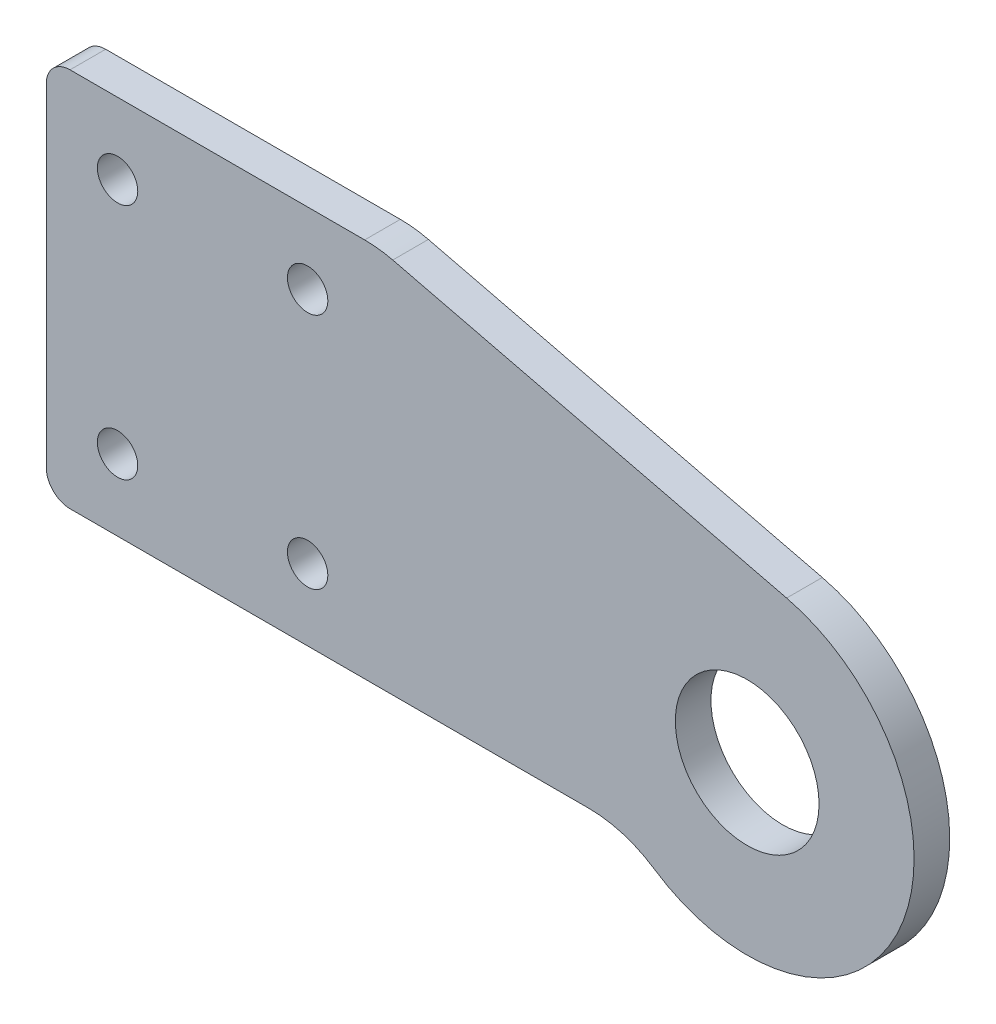
ISO-10303-21;
HEADER;
FILE_DESCRIPTION(('STEP AP214'),'2;1');
FILE_NAME('part.step','',(''),(''),'','','');
FILE_SCHEMA(('AUTOMOTIVE_DESIGN { 1 0 10303 214 1 1 1 1 }'));
ENDSEC;
DATA;
#1=APPLICATION_CONTEXT('core data for automotive mechanical design processes');
#2=APPLICATION_PROTOCOL_DEFINITION('international standard','automotive_design',2000,#1);
#3=PRODUCT_CONTEXT('',#1,'mechanical');
#4=PRODUCT('Part','Part','',(#3));
#5=PRODUCT_RELATED_PRODUCT_CATEGORY('part','',(#4));
#6=PRODUCT_DEFINITION_FORMATION('','',#4);
#7=PRODUCT_DEFINITION_CONTEXT('part definition',#1,'design');
#8=PRODUCT_DEFINITION('design','',#6,#7);
#9=PRODUCT_DEFINITION_SHAPE('','',#8);
#10=(LENGTH_UNIT() NAMED_UNIT(*) SI_UNIT(.MILLI.,.METRE.));
#11=(NAMED_UNIT(*) PLANE_ANGLE_UNIT() SI_UNIT($,.RADIAN.));
#12=(NAMED_UNIT(*) SI_UNIT($,.STERADIAN.) SOLID_ANGLE_UNIT());
#13=UNCERTAINTY_MEASURE_WITH_UNIT(LENGTH_MEASURE(1.E-05),#10,'distance_accuracy_value','');
#14=(GEOMETRIC_REPRESENTATION_CONTEXT(3) GLOBAL_UNCERTAINTY_ASSIGNED_CONTEXT((#13)) GLOBAL_UNIT_ASSIGNED_CONTEXT((#10,
#11,#12)) REPRESENTATION_CONTEXT('',''));
#15=CARTESIAN_POINT('',(0.,0.,0.));
#16=DIRECTION('',(0.,0.,1.));
#17=DIRECTION('',(1.,0.,0.));
#18=AXIS2_PLACEMENT_3D('',#15,#16,#17);
#19=CARTESIAN_POINT('',(0.,0.,0.75));
#20=DIRECTION('',(0.,0.,1.));
#21=DIRECTION('',(1.,0.,0.));
#22=AXIS2_PLACEMENT_3D('',#19,#20,#21);
#23=PLANE('',#22);
#24=CARTESIAN_POINT('',(-18.5,-2.,0.75));
#25=DIRECTION('',(0.,0.,1.));
#26=DIRECTION('',(1.,0.,0.));
#27=AXIS2_PLACEMENT_3D('',#24,#25,#26);
#28=CIRCLE('',#27,0.85);
#29=CARTESIAN_POINT('',(-17.65,-2.,0.75));
#30=VERTEX_POINT('',#29);
#31=EDGE_CURVE('E344',#30,#30,#28,.T.);
#32=ORIENTED_EDGE('',*,*,#31,.F.);
#33=EDGE_LOOP('',(#32));
#34=FACE_BOUND('',#33,.T.);
#35=CARTESIAN_POINT('',(-26.5,8.,0.75));
#36=DIRECTION('',(0.,0.,1.));
#37=DIRECTION('',(1.,0.,0.));
#38=AXIS2_PLACEMENT_3D('',#35,#36,#37);
#39=CIRCLE('',#38,0.85);
#40=CARTESIAN_POINT('',(-25.65,8.,0.75));
#41=VERTEX_POINT('',#40);
#42=EDGE_CURVE('E363',#41,#41,#39,.T.);
#43=ORIENTED_EDGE('',*,*,#42,.F.);
#44=EDGE_LOOP('',(#43));
#45=FACE_BOUND('',#44,.T.);
#46=DIRECTION('',(0.,-1.,0.));
#47=VECTOR('',#46,1.);
#48=CARTESIAN_POINT('',(-29.5,11.,0.75));
#49=LINE('',#48,#47);
#50=CARTESIAN_POINT('',(-29.5,10.,0.75));
#51=VERTEX_POINT('',#50);
#52=CARTESIAN_POINT('',(-29.5,-4.,0.75));
#53=VERTEX_POINT('',#52);
#54=EDGE_CURVE('E145',#51,#53,#49,.T.);
#55=ORIENTED_EDGE('',*,*,#54,.T.);
#56=CARTESIAN_POINT('',(-28.5,-4.,0.75));
#57=DIRECTION('',(0.,0.,1.));
#58=DIRECTION('',(1.,0.,0.));
#59=AXIS2_PLACEMENT_3D('',#56,#57,#58);
#60=CIRCLE('',#59,1.);
#61=CARTESIAN_POINT('',(-28.5,-5.,0.75));
#62=VERTEX_POINT('',#61);
#63=EDGE_CURVE('E40',#53,#62,#60,.T.);
#64=ORIENTED_EDGE('',*,*,#63,.T.);
#65=DIRECTION('',(1.,0.,0.));
#66=VECTOR('',#65,1.);
#67=CARTESIAN_POINT('',(-29.5,-5.,0.75));
#68=LINE('',#67,#66);
#69=CARTESIAN_POINT('',(-6.67836993584512,-5.,0.75));
#70=VERTEX_POINT('',#69);
#71=EDGE_CURVE('E116',#62,#70,#68,.T.);
#72=ORIENTED_EDGE('',*,*,#71,.T.);
#73=CARTESIAN_POINT('',(-6.67836993584512,-10.,0.75));
#74=DIRECTION('',(0.,0.,1.));
#75=DIRECTION('',(1.,0.,0.));
#76=AXIS2_PLACEMENT_3D('',#73,#74,#75);
#77=CIRCLE('',#76,5.);
#78=CARTESIAN_POINT('',(-3.90150093965173,-5.84199584199584,0.75));
#79=VERTEX_POINT('',#78);
#80=EDGE_CURVE('E112',#70,#79,#77,.F.);
#81=ORIENTED_EDGE('',*,*,#80,.T.);
#82=CARTESIAN_POINT('',(0.,0.,0.75));
#83=DIRECTION('',(0.,0.,1.));
#84=DIRECTION('',(1.,0.,0.));
#85=AXIS2_PLACEMENT_3D('',#82,#83,#84);
#86=CIRCLE('',#85,7.025);
#87=CARTESIAN_POINT('',(1.66032893490754,6.82597486282427,0.75));
#88=VERTEX_POINT('',#87);
#89=EDGE_CURVE('E105',#79,#88,#86,.T.);
#90=ORIENTED_EDGE('',*,*,#89,.T.);
#91=DIRECTION('',(-0.971669019619113,0.236345755858725,0.));
#92=VECTOR('',#91,1.);
#93=CARTESIAN_POINT('',(-15.5,11.,0.75));
#94=LINE('',#93,#92);
#95=CARTESIAN_POINT('',(-14.9176257612174,10.8583450980956,0.75));
#96=VERTEX_POINT('',#95);
#97=EDGE_CURVE('E109',#88,#96,#94,.T.);
#98=ORIENTED_EDGE('',*,*,#97,.T.);
#99=CARTESIAN_POINT('',(-16.099354540511,6.,0.75));
#100=DIRECTION('',(0.,0.,1.));
#101=DIRECTION('',(1.,0.,0.));
#102=AXIS2_PLACEMENT_3D('',#99,#100,#101);
#103=CIRCLE('',#102,5.);
#104=CARTESIAN_POINT('',(-16.099354540511,11.,0.75));
#105=VERTEX_POINT('',#104);
#106=EDGE_CURVE('E157',#96,#105,#103,.T.);
#107=ORIENTED_EDGE('',*,*,#106,.T.);
#108=DIRECTION('',(-1.,0.,0.));
#109=VECTOR('',#108,1.);
#110=CARTESIAN_POINT('',(-29.5,11.,0.75));
#111=LINE('',#110,#109);
#112=CARTESIAN_POINT('',(-28.5,11.,0.75));
#113=VERTEX_POINT('',#112);
#114=EDGE_CURVE('E127',#105,#113,#111,.T.);
#115=ORIENTED_EDGE('',*,*,#114,.T.);
#116=CARTESIAN_POINT('',(-28.5,10.,0.75));
#117=DIRECTION('',(0.,0.,1.));
#118=DIRECTION('',(1.,0.,0.));
#119=AXIS2_PLACEMENT_3D('',#116,#117,#118);
#120=CIRCLE('',#119,1.);
#121=EDGE_CURVE('E174',#113,#51,#120,.T.);
#122=ORIENTED_EDGE('',*,*,#121,.T.);
#123=EDGE_LOOP('',(#55,#64,#72,#81,#90,#98,#107,#115,#122));
#124=FACE_BOUND('',#123,.T.);
#125=CARTESIAN_POINT('',(0.,0.,0.75));
#126=DIRECTION('',(0.,0.,1.));
#127=DIRECTION('',(1.,0.,0.));
#128=AXIS2_PLACEMENT_3D('',#125,#126,#127);
#129=CIRCLE('',#128,3.025);
#130=CARTESIAN_POINT('',(3.025,0.,0.75));
#131=VERTEX_POINT('',#130);
#132=EDGE_CURVE('E139',#131,#131,#129,.T.);
#133=ORIENTED_EDGE('',*,*,#132,.F.);
#134=EDGE_LOOP('',(#133));
#135=FACE_BOUND('',#134,.T.);
#136=CARTESIAN_POINT('',(-18.5,8.,0.75));
#137=DIRECTION('',(0.,0.,1.));
#138=DIRECTION('',(1.,0.,0.));
#139=AXIS2_PLACEMENT_3D('',#136,#137,#138);
#140=CIRCLE('',#139,0.85);
#141=CARTESIAN_POINT('',(-17.65,8.,0.75));
#142=VERTEX_POINT('',#141);
#143=EDGE_CURVE('E357',#142,#142,#140,.T.);
#144=ORIENTED_EDGE('',*,*,#143,.F.);
#145=EDGE_LOOP('',(#144));
#146=FACE_BOUND('',#145,.T.);
#147=CARTESIAN_POINT('',(-26.5,-2.,0.75));
#148=DIRECTION('',(0.,0.,1.));
#149=DIRECTION('',(1.,0.,0.));
#150=AXIS2_PLACEMENT_3D('',#147,#148,#149);
#151=CIRCLE('',#150,0.85);
#152=CARTESIAN_POINT('',(-25.65,-2.,0.75));
#153=VERTEX_POINT('',#152);
#154=EDGE_CURVE('E348',#153,#153,#151,.T.);
#155=ORIENTED_EDGE('',*,*,#154,.F.);
#156=EDGE_LOOP('',(#155));
#157=FACE_BOUND('',#156,.T.);
#158=ADVANCED_FACE('F32',(#34,#45,#124,#135,#146,#157),#23,.T.);
#159=CARTESIAN_POINT('',(0.,0.,-0.75));
#160=DIRECTION('',(0.,0.,1.));
#161=DIRECTION('',(1.,0.,0.));
#162=AXIS2_PLACEMENT_3D('',#159,#160,#161);
#163=PLANE('',#162);
#164=CARTESIAN_POINT('',(-18.5,-2.,-0.75));
#165=DIRECTION('',(0.,0.,1.));
#166=DIRECTION('',(1.,0.,0.));
#167=AXIS2_PLACEMENT_3D('',#164,#165,#166);
#168=CIRCLE('',#167,0.85);
#169=CARTESIAN_POINT('',(-17.65,-2.,-0.75));
#170=VERTEX_POINT('',#169);
#171=EDGE_CURVE('E347',#170,#170,#168,.T.);
#172=ORIENTED_EDGE('',*,*,#171,.T.);
#173=EDGE_LOOP('',(#172));
#174=FACE_BOUND('',#173,.T.);
#175=CARTESIAN_POINT('',(-26.5,8.,-0.75));
#176=DIRECTION('',(0.,0.,1.));
#177=DIRECTION('',(1.,0.,0.));
#178=AXIS2_PLACEMENT_3D('',#175,#176,#177);
#179=CIRCLE('',#178,0.85);
#180=CARTESIAN_POINT('',(-25.65,8.,-0.75));
#181=VERTEX_POINT('',#180);
#182=EDGE_CURVE('E360',#181,#181,#179,.T.);
#183=ORIENTED_EDGE('',*,*,#182,.T.);
#184=EDGE_LOOP('',(#183));
#185=FACE_BOUND('',#184,.T.);
#186=DIRECTION('',(1.,0.,0.));
#187=VECTOR('',#186,1.);
#188=CARTESIAN_POINT('',(-15.5,-5.,-0.75));
#189=LINE('',#188,#187);
#190=CARTESIAN_POINT('',(-28.5,-5.,-0.75));
#191=VERTEX_POINT('',#190);
#192=CARTESIAN_POINT('',(-6.67836993584512,-5.,-0.75));
#193=VERTEX_POINT('',#192);
#194=EDGE_CURVE('E138',#191,#193,#189,.T.);
#195=ORIENTED_EDGE('',*,*,#194,.F.);
#196=CARTESIAN_POINT('',(-28.5,-4.,-0.75));
#197=DIRECTION('',(0.,0.,1.));
#198=DIRECTION('',(1.,0.,0.));
#199=AXIS2_PLACEMENT_3D('',#196,#197,#198);
#200=CIRCLE('',#199,1.);
#201=CARTESIAN_POINT('',(-29.5,-4.,-0.75));
#202=VERTEX_POINT('',#201);
#203=EDGE_CURVE('E168',#191,#202,#200,.F.);
#204=ORIENTED_EDGE('',*,*,#203,.T.);
#205=DIRECTION('',(0.,-1.,0.));
#206=VECTOR('',#205,1.);
#207=CARTESIAN_POINT('',(-29.5,11.,-0.75));
#208=LINE('',#207,#206);
#209=CARTESIAN_POINT('',(-29.5,10.,-0.75));
#210=VERTEX_POINT('',#209);
#211=EDGE_CURVE('E136',#210,#202,#208,.T.);
#212=ORIENTED_EDGE('',*,*,#211,.F.);
#213=CARTESIAN_POINT('',(-28.5,10.,-0.75));
#214=DIRECTION('',(0.,0.,1.));
#215=DIRECTION('',(1.,0.,0.));
#216=AXIS2_PLACEMENT_3D('',#213,#214,#215);
#217=CIRCLE('',#216,1.);
#218=CARTESIAN_POINT('',(-28.5,11.,-0.75));
#219=VERTEX_POINT('',#218);
#220=EDGE_CURVE('E166',#210,#219,#217,.F.);
#221=ORIENTED_EDGE('',*,*,#220,.T.);
#222=DIRECTION('',(-1.,0.,0.));
#223=VECTOR('',#222,1.);
#224=CARTESIAN_POINT('',(-29.5,11.,-0.75));
#225=LINE('',#224,#223);
#226=CARTESIAN_POINT('',(-16.099354540511,11.,-0.75));
#227=VERTEX_POINT('',#226);
#228=EDGE_CURVE('E144',#227,#219,#225,.T.);
#229=ORIENTED_EDGE('',*,*,#228,.F.);
#230=CARTESIAN_POINT('',(-16.099354540511,6.,-0.75));
#231=DIRECTION('',(0.,0.,1.));
#232=DIRECTION('',(1.,0.,0.));
#233=AXIS2_PLACEMENT_3D('',#230,#231,#232);
#234=CIRCLE('',#233,5.);
#235=CARTESIAN_POINT('',(-14.9176257612174,10.8583450980956,-0.75));
#236=VERTEX_POINT('',#235);
#237=EDGE_CURVE('E154',#227,#236,#234,.F.);
#238=ORIENTED_EDGE('',*,*,#237,.T.);
#239=DIRECTION('',(-0.971669019619113,0.236345755858725,0.));
#240=VECTOR('',#239,1.);
#241=CARTESIAN_POINT('',(-15.5,11.,-0.75));
#242=LINE('',#241,#240);
#243=CARTESIAN_POINT('',(1.66032893490754,6.82597486282427,-0.75));
#244=VERTEX_POINT('',#243);
#245=EDGE_CURVE('E142',#244,#236,#242,.T.);
#246=ORIENTED_EDGE('',*,*,#245,.F.);
#247=CARTESIAN_POINT('',(0.,0.,-0.75));
#248=DIRECTION('',(0.,0.,1.));
#249=DIRECTION('',(1.,0.,0.));
#250=AXIS2_PLACEMENT_3D('',#247,#248,#249);
#251=CIRCLE('',#250,7.025);
#252=CARTESIAN_POINT('',(-3.90150093965173,-5.84199584199584,-0.75));
#253=VERTEX_POINT('',#252);
#254=EDGE_CURVE('E122',#253,#244,#251,.T.);
#255=ORIENTED_EDGE('',*,*,#254,.F.);
#256=CARTESIAN_POINT('',(-6.67836993584512,-10.,-0.75));
#257=DIRECTION('',(0.,0.,1.));
#258=DIRECTION('',(1.,0.,0.));
#259=AXIS2_PLACEMENT_3D('',#256,#257,#258);
#260=CIRCLE('',#259,5.);
#261=EDGE_CURVE('E159',#253,#193,#260,.T.);
#262=ORIENTED_EDGE('',*,*,#261,.T.);
#263=EDGE_LOOP('',(#195,#204,#212,#221,#229,#238,#246,#255,#262));
#264=FACE_BOUND('',#263,.T.);
#265=CARTESIAN_POINT('',(0.,0.,-0.75));
#266=DIRECTION('',(0.,0.,1.));
#267=DIRECTION('',(1.,0.,0.));
#268=AXIS2_PLACEMENT_3D('',#265,#266,#267);
#269=CIRCLE('',#268,3.025);
#270=CARTESIAN_POINT('',(3.025,0.,-0.75));
#271=VERTEX_POINT('',#270);
#272=EDGE_CURVE('E366',#271,#271,#269,.T.);
#273=ORIENTED_EDGE('',*,*,#272,.T.);
#274=EDGE_LOOP('',(#273));
#275=FACE_BOUND('',#274,.T.);
#276=CARTESIAN_POINT('',(-18.5,8.,-0.75));
#277=DIRECTION('',(0.,0.,1.));
#278=DIRECTION('',(1.,0.,0.));
#279=AXIS2_PLACEMENT_3D('',#276,#277,#278);
#280=CIRCLE('',#279,0.85);
#281=CARTESIAN_POINT('',(-17.65,8.,-0.75));
#282=VERTEX_POINT('',#281);
#283=EDGE_CURVE('E350',#282,#282,#280,.T.);
#284=ORIENTED_EDGE('',*,*,#283,.T.);
#285=EDGE_LOOP('',(#284));
#286=FACE_BOUND('',#285,.T.);
#287=CARTESIAN_POINT('',(-26.5,-2.,-0.75));
#288=DIRECTION('',(0.,0.,1.));
#289=DIRECTION('',(1.,0.,0.));
#290=AXIS2_PLACEMENT_3D('',#287,#288,#289);
#291=CIRCLE('',#290,0.85);
#292=CARTESIAN_POINT('',(-25.65,-2.,-0.75));
#293=VERTEX_POINT('',#292);
#294=EDGE_CURVE('E353',#293,#293,#291,.T.);
#295=ORIENTED_EDGE('',*,*,#294,.T.);
#296=EDGE_LOOP('',(#295));
#297=FACE_BOUND('',#296,.T.);
#298=ADVANCED_FACE('F186',(#174,#185,#264,#275,#286,#297),#163,.F.);
#299=CARTESIAN_POINT('',(-29.5,11.,0.75));
#300=DIRECTION('',(1.,0.,0.));
#301=DIRECTION('',(0.,0.,-1.));
#302=AXIS2_PLACEMENT_3D('',#299,#300,#301);
#303=PLANE('',#302);
#304=ORIENTED_EDGE('',*,*,#211,.T.);
#305=DIRECTION('',(0.,0.,-1.));
#306=VECTOR('',#305,1.);
#307=CARTESIAN_POINT('',(-29.5,-4.,0.75));
#308=LINE('',#307,#306);
#309=EDGE_CURVE('E53',#202,#53,#308,.F.);
#310=ORIENTED_EDGE('',*,*,#309,.T.);
#311=ORIENTED_EDGE('',*,*,#54,.F.);
#312=DIRECTION('',(0.,0.,-1.));
#313=VECTOR('',#312,1.);
#314=CARTESIAN_POINT('',(-29.5,10.,0.75));
#315=LINE('',#314,#313);
#316=EDGE_CURVE('E170',#51,#210,#315,.T.);
#317=ORIENTED_EDGE('',*,*,#316,.T.);
#318=EDGE_LOOP('',(#304,#310,#311,#317));
#319=FACE_BOUND('',#318,.T.);
#320=ADVANCED_FACE('F188',(#319),#303,.F.);
#321=CARTESIAN_POINT('',(-15.5,-5.,0.75));
#322=DIRECTION('',(0.,1.,0.));
#323=DIRECTION('',(-1.,0.,0.));
#324=AXIS2_PLACEMENT_3D('',#321,#322,#323);
#325=PLANE('',#324);
#326=ORIENTED_EDGE('',*,*,#71,.F.);
#327=DIRECTION('',(0.,0.,-1.));
#328=VECTOR('',#327,1.);
#329=CARTESIAN_POINT('',(-28.5,-5.,0.75));
#330=LINE('',#329,#328);
#331=EDGE_CURVE('E163',#62,#191,#330,.T.);
#332=ORIENTED_EDGE('',*,*,#331,.T.);
#333=ORIENTED_EDGE('',*,*,#194,.T.);
#334=DIRECTION('',(0.,0.,1.));
#335=VECTOR('',#334,1.);
#336=CARTESIAN_POINT('',(-6.67836993584512,-5.,0.75));
#337=LINE('',#336,#335);
#338=EDGE_CURVE('E148',#193,#70,#337,.T.);
#339=ORIENTED_EDGE('',*,*,#338,.T.);
#340=EDGE_LOOP('',(#326,#332,#333,#339));
#341=FACE_BOUND('',#340,.T.);
#342=ADVANCED_FACE('F180',(#341),#325,.F.);
#343=CARTESIAN_POINT('',(0.,0.,0.75));
#344=DIRECTION('',(0.,0.,-1.));
#345=DIRECTION('',(-1.,0.,0.));
#346=AXIS2_PLACEMENT_3D('',#343,#344,#345);
#347=CYLINDRICAL_SURFACE('',#346,7.025);
#348=ORIENTED_EDGE('',*,*,#89,.F.);
#349=DIRECTION('',(0.,0.,-1.));
#350=VECTOR('',#349,1.);
#351=CARTESIAN_POINT('',(-3.90150093965173,-5.84199584199584,0.75));
#352=LINE('',#351,#350);
#353=EDGE_CURVE('E126',#79,#253,#352,.T.);
#354=ORIENTED_EDGE('',*,*,#353,.T.);
#355=ORIENTED_EDGE('',*,*,#254,.T.);
#356=DIRECTION('',(0.,0.,-1.));
#357=VECTOR('',#356,1.);
#358=CARTESIAN_POINT('',(1.66032893490754,6.82597486282427,0.75));
#359=LINE('',#358,#357);
#360=EDGE_CURVE('E119',#88,#244,#359,.T.);
#361=ORIENTED_EDGE('',*,*,#360,.F.);
#362=EDGE_LOOP('',(#348,#354,#355,#361));
#363=FACE_BOUND('',#362,.T.);
#364=ADVANCED_FACE('F120',(#363),#347,.T.);
#365=CARTESIAN_POINT('',(-15.5,11.,0.75));
#366=DIRECTION('',(-0.236345755858725,-0.971669019619113,0.));
#367=DIRECTION('',(0.971669019619113,-0.236345755858725,0.));
#368=AXIS2_PLACEMENT_3D('',#365,#366,#367);
#369=PLANE('',#368);
#370=ORIENTED_EDGE('',*,*,#245,.T.);
#371=DIRECTION('',(0.,0.,-1.));
#372=VECTOR('',#371,1.);
#373=CARTESIAN_POINT('',(-14.9176257612174,10.8583450980956,0.75));
#374=LINE('',#373,#372);
#375=EDGE_CURVE('E131',#236,#96,#374,.F.);
#376=ORIENTED_EDGE('',*,*,#375,.T.);
#377=ORIENTED_EDGE('',*,*,#97,.F.);
#378=ORIENTED_EDGE('',*,*,#360,.T.);
#379=EDGE_LOOP('',(#370,#376,#377,#378));
#380=FACE_BOUND('',#379,.T.);
#381=ADVANCED_FACE('F129',(#380),#369,.F.);
#382=CARTESIAN_POINT('',(-29.5,11.,0.75));
#383=DIRECTION('',(0.,-1.,0.));
#384=DIRECTION('',(0.,0.,-1.));
#385=AXIS2_PLACEMENT_3D('',#382,#383,#384);
#386=PLANE('',#385);
#387=ORIENTED_EDGE('',*,*,#228,.T.);
#388=DIRECTION('',(0.,0.,-1.));
#389=VECTOR('',#388,1.);
#390=CARTESIAN_POINT('',(-28.5,11.,0.75));
#391=LINE('',#390,#389);
#392=EDGE_CURVE('E11',#219,#113,#391,.F.);
#393=ORIENTED_EDGE('',*,*,#392,.T.);
#394=ORIENTED_EDGE('',*,*,#114,.F.);
#395=DIRECTION('',(0.,0.,-1.));
#396=VECTOR('',#395,1.);
#397=CARTESIAN_POINT('',(-16.099354540511,11.,0.75));
#398=LINE('',#397,#396);
#399=EDGE_CURVE('E151',#105,#227,#398,.T.);
#400=ORIENTED_EDGE('',*,*,#399,.T.);
#401=EDGE_LOOP('',(#387,#393,#394,#400));
#402=FACE_BOUND('',#401,.T.);
#403=ADVANCED_FACE('F193',(#402),#386,.F.);
#404=CARTESIAN_POINT('',(0.,0.,0.75));
#405=DIRECTION('',(0.,0.,-1.));
#406=DIRECTION('',(-1.,0.,0.));
#407=AXIS2_PLACEMENT_3D('',#404,#405,#406);
#408=CYLINDRICAL_SURFACE('',#407,3.025);
#409=ORIENTED_EDGE('',*,*,#132,.T.);
#410=EDGE_LOOP('',(#409));
#411=FACE_BOUND('',#410,.T.);
#412=ORIENTED_EDGE('',*,*,#272,.F.);
#413=EDGE_LOOP('',(#412));
#414=FACE_BOUND('',#413,.T.);
#415=ADVANCED_FACE('F222',(#411,#414),#408,.F.);
#416=CARTESIAN_POINT('',(-26.5,8.,0.75));
#417=DIRECTION('',(0.,0.,-1.));
#418=DIRECTION('',(-1.,0.,0.));
#419=AXIS2_PLACEMENT_3D('',#416,#417,#418);
#420=CYLINDRICAL_SURFACE('',#419,0.85);
#421=ORIENTED_EDGE('',*,*,#42,.T.);
#422=EDGE_LOOP('',(#421));
#423=FACE_BOUND('',#422,.T.);
#424=ORIENTED_EDGE('',*,*,#182,.F.);
#425=EDGE_LOOP('',(#424));
#426=FACE_BOUND('',#425,.T.);
#427=ADVANCED_FACE('F261',(#423,#426),#420,.F.);
#428=CARTESIAN_POINT('',(-18.5,8.,0.75));
#429=DIRECTION('',(0.,0.,-1.));
#430=DIRECTION('',(-1.,0.,0.));
#431=AXIS2_PLACEMENT_3D('',#428,#429,#430);
#432=CYLINDRICAL_SURFACE('',#431,0.85);
#433=ORIENTED_EDGE('',*,*,#143,.T.);
#434=EDGE_LOOP('',(#433));
#435=FACE_BOUND('',#434,.T.);
#436=ORIENTED_EDGE('',*,*,#283,.F.);
#437=EDGE_LOOP('',(#436));
#438=FACE_BOUND('',#437,.T.);
#439=ADVANCED_FACE('F268',(#435,#438),#432,.F.);
#440=CARTESIAN_POINT('',(-18.5,-2.,0.75));
#441=DIRECTION('',(0.,0.,-1.));
#442=DIRECTION('',(-1.,0.,0.));
#443=AXIS2_PLACEMENT_3D('',#440,#441,#442);
#444=CYLINDRICAL_SURFACE('',#443,0.85);
#445=ORIENTED_EDGE('',*,*,#31,.T.);
#446=EDGE_LOOP('',(#445));
#447=FACE_BOUND('',#446,.T.);
#448=ORIENTED_EDGE('',*,*,#171,.F.);
#449=EDGE_LOOP('',(#448));
#450=FACE_BOUND('',#449,.T.);
#451=ADVANCED_FACE('F207',(#447,#450),#444,.F.);
#452=CARTESIAN_POINT('',(-26.5,-2.,0.75));
#453=DIRECTION('',(0.,0.,-1.));
#454=DIRECTION('',(-1.,0.,0.));
#455=AXIS2_PLACEMENT_3D('',#452,#453,#454);
#456=CYLINDRICAL_SURFACE('',#455,0.85);
#457=ORIENTED_EDGE('',*,*,#154,.T.);
#458=EDGE_LOOP('',(#457));
#459=FACE_BOUND('',#458,.T.);
#460=ORIENTED_EDGE('',*,*,#294,.F.);
#461=EDGE_LOOP('',(#460));
#462=FACE_BOUND('',#461,.T.);
#463=ADVANCED_FACE('F200',(#459,#462),#456,.F.);
#464=CARTESIAN_POINT('',(-6.67836993584512,-10.,0.75));
#465=DIRECTION('',(0.,0.,-1.));
#466=DIRECTION('',(-1.,0.,0.));
#467=AXIS2_PLACEMENT_3D('',#464,#465,#466);
#468=CYLINDRICAL_SURFACE('',#467,5.);
#469=ORIENTED_EDGE('',*,*,#80,.F.);
#470=ORIENTED_EDGE('',*,*,#338,.F.);
#471=ORIENTED_EDGE('',*,*,#261,.F.);
#472=ORIENTED_EDGE('',*,*,#353,.F.);
#473=EDGE_LOOP('',(#469,#470,#471,#472));
#474=FACE_BOUND('',#473,.T.);
#475=ADVANCED_FACE('F198',(#474),#468,.F.);
#476=CARTESIAN_POINT('',(-16.099354540511,6.,0.75));
#477=DIRECTION('',(0.,0.,-1.));
#478=DIRECTION('',(-1.,0.,0.));
#479=AXIS2_PLACEMENT_3D('',#476,#477,#478);
#480=CYLINDRICAL_SURFACE('',#479,5.);
#481=ORIENTED_EDGE('',*,*,#106,.F.);
#482=ORIENTED_EDGE('',*,*,#375,.F.);
#483=ORIENTED_EDGE('',*,*,#237,.F.);
#484=ORIENTED_EDGE('',*,*,#399,.F.);
#485=EDGE_LOOP('',(#481,#482,#483,#484));
#486=FACE_BOUND('',#485,.T.);
#487=ADVANCED_FACE('F196',(#486),#480,.T.);
#488=CARTESIAN_POINT('',(-28.5,-4.,0.75));
#489=DIRECTION('',(0.,0.,-1.));
#490=DIRECTION('',(-1.,0.,0.));
#491=AXIS2_PLACEMENT_3D('',#488,#489,#490);
#492=CYLINDRICAL_SURFACE('',#491,1.);
#493=ORIENTED_EDGE('',*,*,#63,.F.);
#494=ORIENTED_EDGE('',*,*,#309,.F.);
#495=ORIENTED_EDGE('',*,*,#203,.F.);
#496=ORIENTED_EDGE('',*,*,#331,.F.);
#497=EDGE_LOOP('',(#493,#494,#495,#496));
#498=FACE_BOUND('',#497,.T.);
#499=ADVANCED_FACE('F183',(#498),#492,.T.);
#500=CARTESIAN_POINT('',(-28.5,10.,0.75));
#501=DIRECTION('',(0.,0.,-1.));
#502=DIRECTION('',(-1.,0.,0.));
#503=AXIS2_PLACEMENT_3D('',#500,#501,#502);
#504=CYLINDRICAL_SURFACE('',#503,1.);
#505=ORIENTED_EDGE('',*,*,#121,.F.);
#506=ORIENTED_EDGE('',*,*,#392,.F.);
#507=ORIENTED_EDGE('',*,*,#220,.F.);
#508=ORIENTED_EDGE('',*,*,#316,.F.);
#509=EDGE_LOOP('',(#505,#506,#507,#508));
#510=FACE_BOUND('',#509,.T.);
#511=ADVANCED_FACE('F34',(#510),#504,.T.);
#512=CLOSED_SHELL('',(#158,#298,#320,#342,#364,#381,#403,#415,#427,#439,#451,#463,#475,#487,
#499,#511));
#513=MANIFOLD_SOLID_BREP('B2',#512);
#514=ADVANCED_BREP_SHAPE_REPRESENTATION('',(#18,#513),#14);
#515=SHAPE_DEFINITION_REPRESENTATION(#9,#514);
ENDSEC;
END-ISO-10303-21;
